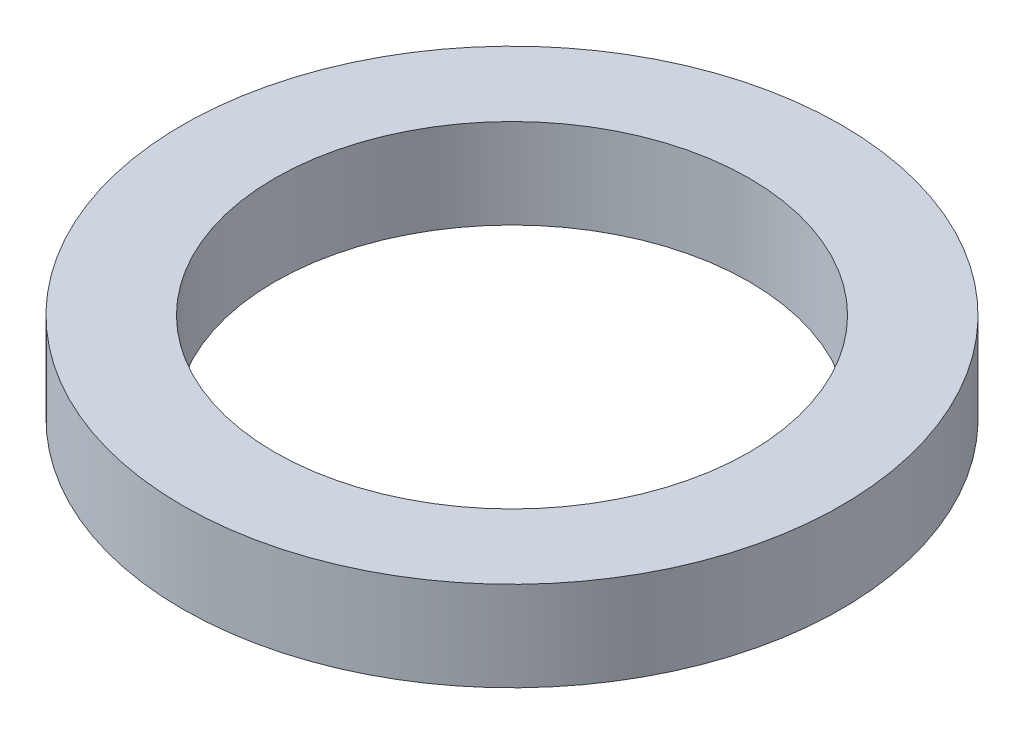
ISO-10303-21;
HEADER;
FILE_DESCRIPTION(('STEP AP214'),'2;1');
FILE_NAME('part.step','',(''),(''),'','','');
FILE_SCHEMA(('AUTOMOTIVE_DESIGN { 1 0 10303 214 1 1 1 1 }'));
ENDSEC;
DATA;
#1=APPLICATION_CONTEXT('core data for automotive mechanical design processes');
#2=APPLICATION_PROTOCOL_DEFINITION('international standard','automotive_design',2000,#1);
#3=PRODUCT_CONTEXT('',#1,'mechanical');
#4=PRODUCT('Part','Part','',(#3));
#5=PRODUCT_RELATED_PRODUCT_CATEGORY('part','',(#4));
#6=PRODUCT_DEFINITION_FORMATION('','',#4);
#7=PRODUCT_DEFINITION_CONTEXT('part definition',#1,'design');
#8=PRODUCT_DEFINITION('design','',#6,#7);
#9=PRODUCT_DEFINITION_SHAPE('','',#8);
#10=(LENGTH_UNIT() NAMED_UNIT(*) SI_UNIT(.MILLI.,.METRE.));
#11=(NAMED_UNIT(*) PLANE_ANGLE_UNIT() SI_UNIT($,.RADIAN.));
#12=(NAMED_UNIT(*) SI_UNIT($,.STERADIAN.) SOLID_ANGLE_UNIT());
#13=UNCERTAINTY_MEASURE_WITH_UNIT(LENGTH_MEASURE(1.E-05),#10,'distance_accuracy_value','');
#14=(GEOMETRIC_REPRESENTATION_CONTEXT(3) GLOBAL_UNCERTAINTY_ASSIGNED_CONTEXT((#13)) GLOBAL_UNIT_ASSIGNED_CONTEXT((#10,
#11,#12)) REPRESENTATION_CONTEXT('',''));
#15=CARTESIAN_POINT('',(0.,0.,0.));
#16=DIRECTION('',(0.,0.,1.));
#17=DIRECTION('',(1.,0.,0.));
#18=AXIS2_PLACEMENT_3D('',#15,#16,#17);
#19=CARTESIAN_POINT('',(0.,17.,0.));
#20=DIRECTION('',(0.,-1.,0.));
#21=DIRECTION('',(0.,0.,-1.));
#22=AXIS2_PLACEMENT_3D('',#19,#20,#21);
#23=CYLINDRICAL_SURFACE('',#22,62.5);
#24=CARTESIAN_POINT('',(0.,17.,0.));
#25=DIRECTION('',(0.,1.,0.));
#26=DIRECTION('',(0.,0.,1.));
#27=AXIS2_PLACEMENT_3D('',#24,#25,#26);
#28=CIRCLE('',#27,62.5);
#29=CARTESIAN_POINT('',(0.,17.,62.5));
#30=VERTEX_POINT('',#29);
#31=EDGE_CURVE('E10',#30,#30,#28,.T.);
#32=ORIENTED_EDGE('',*,*,#31,.F.);
#33=EDGE_LOOP('',(#32));
#34=FACE_BOUND('',#33,.T.);
#35=CARTESIAN_POINT('',(0.,0.,0.));
#36=DIRECTION('',(0.,1.,0.));
#37=DIRECTION('',(0.,0.,1.));
#38=AXIS2_PLACEMENT_3D('',#35,#36,#37);
#39=CIRCLE('',#38,62.5);
#40=CARTESIAN_POINT('',(0.,0.,62.5));
#41=VERTEX_POINT('',#40);
#42=EDGE_CURVE('E37',#41,#41,#39,.T.);
#43=ORIENTED_EDGE('',*,*,#42,.T.);
#44=EDGE_LOOP('',(#43));
#45=FACE_BOUND('',#44,.T.);
#46=ADVANCED_FACE('F40',(#34,#45),#23,.T.);
#47=CARTESIAN_POINT('',(0.,17.,0.));
#48=DIRECTION('',(0.,1.,0.));
#49=DIRECTION('',(0.,0.,1.));
#50=AXIS2_PLACEMENT_3D('',#47,#48,#49);
#51=PLANE('',#50);
#52=CARTESIAN_POINT('',(0.,17.,0.));
#53=DIRECTION('',(0.,1.,0.));
#54=DIRECTION('',(0.,0.,1.));
#55=AXIS2_PLACEMENT_3D('',#52,#53,#54);
#56=CIRCLE('',#55,45.);
#57=CARTESIAN_POINT('',(0.,17.,45.));
#58=VERTEX_POINT('',#57);
#59=EDGE_CURVE('E50',#58,#58,#56,.T.);
#60=ORIENTED_EDGE('',*,*,#59,.F.);
#61=EDGE_LOOP('',(#60));
#62=FACE_BOUND('',#61,.T.);
#63=ORIENTED_EDGE('',*,*,#31,.T.);
#64=EDGE_LOOP('',(#63));
#65=FACE_BOUND('',#64,.T.);
#66=ADVANCED_FACE('F59',(#62,#65),#51,.T.);
#67=CARTESIAN_POINT('',(0.,0.,0.));
#68=DIRECTION('',(0.,1.,0.));
#69=DIRECTION('',(0.,0.,1.));
#70=AXIS2_PLACEMENT_3D('',#67,#68,#69);
#71=PLANE('',#70);
#72=CARTESIAN_POINT('',(0.,0.,0.));
#73=DIRECTION('',(0.,1.,0.));
#74=DIRECTION('',(0.,0.,1.));
#75=AXIS2_PLACEMENT_3D('',#72,#73,#74);
#76=CIRCLE('',#75,45.);
#77=CARTESIAN_POINT('',(0.,0.,45.));
#78=VERTEX_POINT('',#77);
#79=EDGE_CURVE('E47',#78,#78,#76,.T.);
#80=ORIENTED_EDGE('',*,*,#79,.T.);
#81=EDGE_LOOP('',(#80));
#82=FACE_BOUND('',#81,.T.);
#83=ORIENTED_EDGE('',*,*,#42,.F.);
#84=EDGE_LOOP('',(#83));
#85=FACE_BOUND('',#84,.T.);
#86=ADVANCED_FACE('F58',(#82,#85),#71,.F.);
#87=CARTESIAN_POINT('',(0.,17.,0.));
#88=DIRECTION('',(0.,-1.,0.));
#89=DIRECTION('',(0.,0.,-1.));
#90=AXIS2_PLACEMENT_3D('',#87,#88,#89);
#91=CYLINDRICAL_SURFACE('',#90,45.);
#92=ORIENTED_EDGE('',*,*,#59,.T.);
#93=EDGE_LOOP('',(#92));
#94=FACE_BOUND('',#93,.T.);
#95=ORIENTED_EDGE('',*,*,#79,.F.);
#96=EDGE_LOOP('',(#95));
#97=FACE_BOUND('',#96,.T.);
#98=ADVANCED_FACE('F54',(#94,#97),#91,.F.);
#99=CLOSED_SHELL('',(#46,#66,#86,#98));
#100=MANIFOLD_SOLID_BREP('B2',#99);
#101=ADVANCED_BREP_SHAPE_REPRESENTATION('',(#18,#100),#14);
#102=SHAPE_DEFINITION_REPRESENTATION(#9,#101);
ENDSEC;
END-ISO-10303-21;
